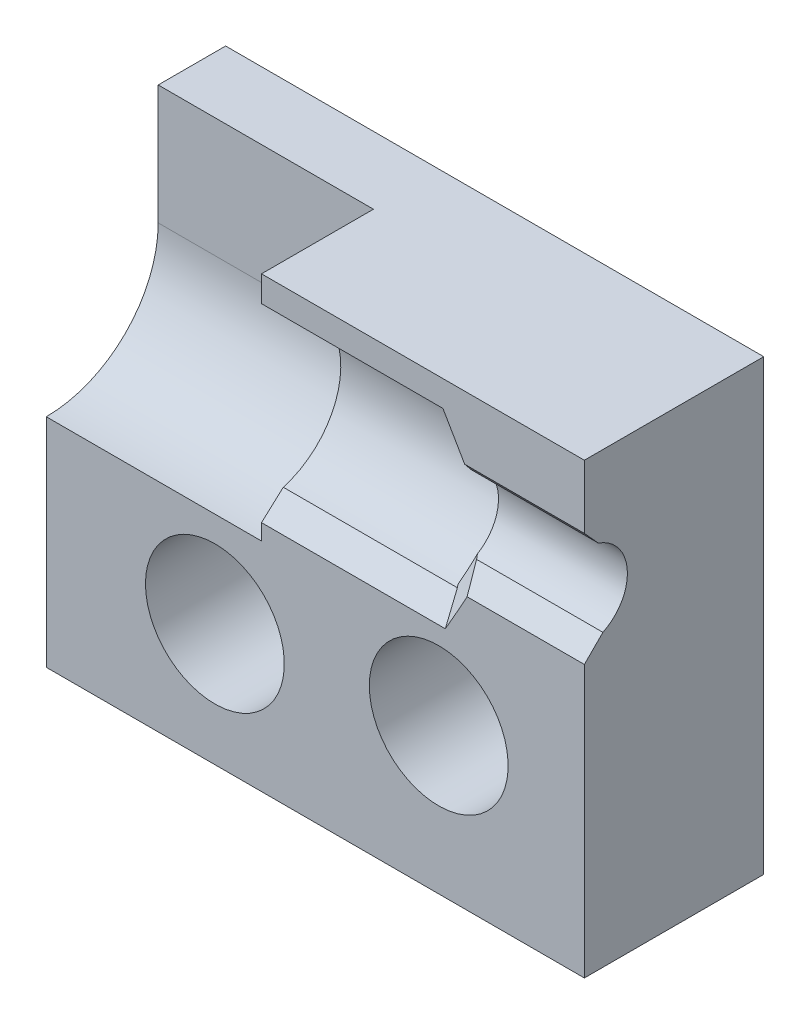
ISO-10303-21;
HEADER;
FILE_DESCRIPTION(('STEP AP214'),'2;1');
FILE_NAME('part.step','',(''),(''),'','','');
FILE_SCHEMA(('AUTOMOTIVE_DESIGN { 1 0 10303 214 1 1 1 1 }'));
ENDSEC;
DATA;
#1=APPLICATION_CONTEXT('core data for automotive mechanical design processes');
#2=APPLICATION_PROTOCOL_DEFINITION('international standard','automotive_design',2000,#1);
#3=PRODUCT_CONTEXT('',#1,'mechanical');
#4=PRODUCT('Part','Part','',(#3));
#5=PRODUCT_RELATED_PRODUCT_CATEGORY('part','',(#4));
#6=PRODUCT_DEFINITION_FORMATION('','',#4);
#7=PRODUCT_DEFINITION_CONTEXT('part definition',#1,'design');
#8=PRODUCT_DEFINITION('design','',#6,#7);
#9=PRODUCT_DEFINITION_SHAPE('','',#8);
#10=(LENGTH_UNIT() NAMED_UNIT(*) SI_UNIT(.MILLI.,.METRE.));
#11=(NAMED_UNIT(*) PLANE_ANGLE_UNIT() SI_UNIT($,.RADIAN.));
#12=(NAMED_UNIT(*) SI_UNIT($,.STERADIAN.) SOLID_ANGLE_UNIT());
#13=UNCERTAINTY_MEASURE_WITH_UNIT(LENGTH_MEASURE(1.E-05),#10,'distance_accuracy_value','');
#14=(GEOMETRIC_REPRESENTATION_CONTEXT(3) GLOBAL_UNCERTAINTY_ASSIGNED_CONTEXT((#13)) GLOBAL_UNIT_ASSIGNED_CONTEXT((#10,
#11,#12)) REPRESENTATION_CONTEXT('',''));
#15=CARTESIAN_POINT('',(0.,0.,0.));
#16=DIRECTION('',(0.,0.,1.));
#17=DIRECTION('',(1.,0.,0.));
#18=AXIS2_PLACEMENT_3D('',#15,#16,#17);
#19=CARTESIAN_POINT('',(0.,15.875,6.35));
#20=DIRECTION('',(0.,0.,-1.));
#21=DIRECTION('',(-1.,0.,0.));
#22=AXIS2_PLACEMENT_3D('',#19,#20,#21);
#23=PLANE('',#22);
#24=CARTESIAN_POINT('',(15.0272325030266,13.2523683147048,6.35));
#25=CARTESIAN_POINT('',(14.6930460971843,13.854183981208,6.35));
#26=CARTESIAN_POINT('',(14.3438732184202,14.4476738563301,6.35));
#27=CARTESIAN_POINT('',(13.9950574192766,15.0411122708672,6.35));
#28=B_SPLINE_CURVE_WITH_KNOTS('',3,(#24,#25,#26,#27),.UNSPECIFIED.,.F.,.F.,(4,4),
(0.0125208708196939,0.0145860459214774),.UNSPECIFIED.);
#29=CARTESIAN_POINT('',(14.0426262246929,14.9601839397091,6.35));
#30=VERTEX_POINT('',#29);
#31=CARTESIAN_POINT('',(14.813371744153,13.6331934584509,6.35));
#32=VERTEX_POINT('',#31);
#33=EDGE_CURVE('E254',#30,#32,#28,.F.);
#34=ORIENTED_EDGE('',*,*,#33,.T.);
#35=DIRECTION('',(1.,0.,0.));
#36=VECTOR('',#35,1.);
#37=CARTESIAN_POINT('',(0.,13.6332163692626,6.35));
#38=LINE('',#37,#36);
#39=CARTESIAN_POINT('',(19.05,13.6332163692626,6.35));
#40=VERTEX_POINT('',#39);
#41=EDGE_CURVE('E247',#32,#40,#38,.T.);
#42=ORIENTED_EDGE('',*,*,#41,.T.);
#43=DIRECTION('',(0.,1.,0.));
#44=VECTOR('',#43,1.);
#45=CARTESIAN_POINT('',(19.05,0.,6.35));
#46=LINE('',#45,#44);
#47=CARTESIAN_POINT('',(19.05,15.875,6.35));
#48=VERTEX_POINT('',#47);
#49=EDGE_CURVE('E179',#40,#48,#46,.T.);
#50=ORIENTED_EDGE('',*,*,#49,.T.);
#51=DIRECTION('',(-1.,0.,0.));
#52=VECTOR('',#51,1.);
#53=CARTESIAN_POINT('',(0.,15.875,6.35));
#54=LINE('',#53,#52);
#55=CARTESIAN_POINT('',(7.62,15.875,6.35));
#56=VERTEX_POINT('',#55);
#57=EDGE_CURVE('E173',#48,#56,#54,.T.);
#58=ORIENTED_EDGE('',*,*,#57,.T.);
#59=DIRECTION('',(0.,1.,0.));
#60=VECTOR('',#59,1.);
#61=CARTESIAN_POINT('',(7.62,15.875,6.35));
#62=LINE('',#61,#60);
#63=CARTESIAN_POINT('',(7.62,14.9602203597438,6.35));
#64=VERTEX_POINT('',#63);
#65=EDGE_CURVE('E153',#64,#56,#62,.T.);
#66=ORIENTED_EDGE('',*,*,#65,.F.);
#67=DIRECTION('',(1.,0.,0.));
#68=VECTOR('',#67,1.);
#69=CARTESIAN_POINT('',(0.,14.9602203597438,6.35));
#70=LINE('',#69,#68);
#71=EDGE_CURVE('E494',#64,#30,#70,.T.);
#72=ORIENTED_EDGE('',*,*,#71,.T.);
#73=EDGE_LOOP('',(#34,#42,#50,#58,#66,#72));
#74=FACE_BOUND('',#73,.T.);
#75=ADVANCED_FACE('F32',(#74),#23,.F.);
#76=CARTESIAN_POINT('',(0.,11.6455203597438,6.35));
#77=DIRECTION('',(-1.,0.,0.));
#78=DIRECTION('',(0.,0.,1.));
#79=AXIS2_PLACEMENT_3D('',#76,#77,#78);
#80=CYLINDRICAL_SURFACE('',#79,1.52399999999999);
#81=CARTESIAN_POINT('',(14.4867239160267,11.6455203597438,6.35));
#82=DIRECTION('',(-1.,0.,0.));
#83=DIRECTION('',(0.,0.,1.));
#84=AXIS2_PLACEMENT_3D('',#81,#82,#83);
#85=CIRCLE('',#84,1.52399999999999);
#86=CARTESIAN_POINT('',(14.4867239160267,13.0586816291112,5.7794290344226));
#87=VERTEX_POINT('',#86);
#88=CARTESIAN_POINT('',(14.4867239160267,10.3355804008468,5.57113332072498));
#89=VERTEX_POINT('',#88);
#90=EDGE_CURVE('E450',#87,#89,#85,.T.);
#91=ORIENTED_EDGE('',*,*,#90,.T.);
#92=CARTESIAN_POINT('',(14.5773362035777,10.2703101149009,5.69321024484276));
#93=CARTESIAN_POINT('',(14.5735542399492,10.2730306487401,5.6881219503381));
#94=CARTESIAN_POINT('',(14.5697716922259,10.275750973923,5.68303397840956));
#95=CARTESIAN_POINT('',(14.5622065403192,10.281190403076,5.67286018080662));
#96=CARTESIAN_POINT('',(14.5584239364809,10.2839095071697,5.66777435494163));
#97=CARTESIAN_POINT('',(14.5508586722863,10.2893464907526,5.65760485343783));
#98=CARTESIAN_POINT('',(14.5470760122767,10.2920643703661,5.65252117760762));
#99=CARTESIAN_POINT('',(14.5395106356788,10.2974989015892,5.64235598015198));
#100=CARTESIAN_POINT('',(14.5357279194389,10.3002155533241,5.63727445833435));
#101=CARTESIAN_POINT('',(14.5281624303206,10.3056476253862,5.62711357288678));
#102=CARTESIAN_POINT('',(14.5243796577921,10.3083630458396,5.62203420906385));
#103=CARTESIAN_POINT('',(14.5168140560365,10.3137926519292,5.61187764359367));
#104=CARTESIAN_POINT('',(14.5130312271608,10.3165068376926,5.60680044175263));
#105=CARTESIAN_POINT('',(14.5054655126515,10.3219339709887,5.59664820423857));
#106=CARTESIAN_POINT('',(14.5016826273708,10.3246469186493,5.59157316837094));
#107=CARTESIAN_POINT('',(14.4941167999893,10.3300715723186,5.58142526680262));
#108=CARTESIAN_POINT('',(14.490333858243,10.3327832784561,5.57635240090651));
#109=CARTESIAN_POINT('',(14.4865503217288,10.3354947679233,5.5712798628187));
#110=B_SPLINE_CURVE_WITH_KNOTS('',3,(#92,#93,#94,#95,#96,#97,#98,#99,#100,#101,#102,#103,#104,
#105,#106,#107,#108,#109),.UNSPECIFIED.,.F.,.F.,(4,2,2,2,2,2,2,2,4),(0.,0.0206968028110682,
0.0413875057109673,0.0620720968516414,0.0827505643743841,0.103422896409848,0.124089081078086,
0.144749106488594,0.165402960740324),.UNSPECIFIED.);
#111=CARTESIAN_POINT('',(14.5773362035777,10.2703101149011,5.69321024484276));
#112=VERTEX_POINT('',#111);
#113=EDGE_CURVE('E498',#89,#112,#110,.F.);
#114=ORIENTED_EDGE('',*,*,#113,.T.);
#115=DIRECTION('',(-1.,0.,0.));
#116=VECTOR('',#115,1.);
#117=CARTESIAN_POINT('',(0.,10.2703101149011,5.69321024484276));
#118=LINE('',#117,#116);
#119=CARTESIAN_POINT('',(19.05,10.2703101149011,5.69321024484276));
#120=VERTEX_POINT('',#119);
#121=EDGE_CURVE('E504',#112,#120,#118,.F.);
#122=ORIENTED_EDGE('',*,*,#121,.T.);
#123=CARTESIAN_POINT('',(19.05,11.6455203597438,6.35));
#124=DIRECTION('',(-1.,0.,0.));
#125=DIRECTION('',(0.,0.,1.));
#126=AXIS2_PLACEMENT_3D('',#123,#124,#125);
#127=CIRCLE('',#126,1.52399999999999);
#128=CARTESIAN_POINT('',(19.05,13.0870454038309,5.85544813490412));
#129=VERTEX_POINT('',#128);
#130=EDGE_CURVE('E194',#129,#120,#127,.T.);
#131=ORIENTED_EDGE('',*,*,#130,.F.);
#132=DIRECTION('',(-1.,0.,0.));
#133=VECTOR('',#132,1.);
#134=CARTESIAN_POINT('',(0.,13.0870454038309,5.85544813490412));
#135=LINE('',#134,#133);
#136=CARTESIAN_POINT('',(14.5567864539065,13.0870454038309,5.85544813490412));
#137=VERTEX_POINT('',#136);
#138=EDGE_CURVE('E506',#129,#137,#135,.T.);
#139=ORIENTED_EDGE('',*,*,#138,.T.);
#140=CARTESIAN_POINT('',(14.4889580050918,13.0546581825526,5.77977641574447));
#141=CARTESIAN_POINT('',(14.9839030485928,13.3302034025834,6.35));
#142=B_SPLINE_CURVE_WITH_KNOTS('',1,(#140,#141),.UNSPECIFIED.,.F.,.F.,(2,2),(0.,1.),.UNSPECIFIED.);
#143=EDGE_CURVE('E429',#137,#87,#142,.F.);
#144=ORIENTED_EDGE('',*,*,#143,.T.);
#145=EDGE_LOOP('',(#91,#114,#122,#131,#139,#144));
#146=FACE_BOUND('',#145,.T.);
#147=ADVANCED_FACE('F234',(#146),#80,.F.);
#148=CARTESIAN_POINT('',(13.8938,5.1562,6.35));
#149=DIRECTION('',(0.,0.,-1.));
#150=DIRECTION('',(-1.,0.,0.));
#151=AXIS2_PLACEMENT_3D('',#148,#149,#150);
#152=CIRCLE('',#151,2.45745);
#153=CARTESIAN_POINT('',(11.43635,5.1562,6.35));
#154=VERTEX_POINT('',#153);
#155=EDGE_CURVE('E724',#154,#154,#152,.T.);
#156=ORIENTED_EDGE('',*,*,#155,.T.);
#157=EDGE_LOOP('',(#156));
#158=FACE_BOUND('',#157,.T.);
#159=CARTESIAN_POINT('',(5.969,4.318,6.35));
#160=DIRECTION('',(0.,0.,-1.));
#161=DIRECTION('',(-1.,0.,0.));
#162=AXIS2_PLACEMENT_3D('',#159,#160,#161);
#163=CIRCLE('',#162,2.45745);
#164=CARTESIAN_POINT('',(3.51155,4.318,6.35));
#165=VERTEX_POINT('',#164);
#166=EDGE_CURVE('E37',#165,#165,#163,.T.);
#167=ORIENTED_EDGE('',*,*,#166,.T.);
#168=EDGE_LOOP('',(#167));
#169=FACE_BOUND('',#168,.T.);
#170=CARTESIAN_POINT('',(14.0771944514698,8.1593071037629,6.35));
#171=CARTESIAN_POINT('',(14.4471798396223,8.80144046239248,6.35));
#172=CARTESIAN_POINT('',(14.8184791245632,9.4438242553936,6.35));
#173=CARTESIAN_POINT('',(15.1567177201664,10.1033175102189,6.35));
#174=B_SPLINE_CURVE_WITH_KNOTS('',3,(#170,#171,#172,#173),.UNSPECIFIED.,.F.,.F.,(4,4),
(0.0132581732775287,0.0154818001649968),.UNSPECIFIED.);
#175=CARTESIAN_POINT('',(14.8984219469262,9.61357444403086,6.35));
#176=VERTEX_POINT('',#175);
#177=CARTESIAN_POINT('',(14.127729104142,8.2468484496813,6.35));
#178=VERTEX_POINT('',#177);
#179=EDGE_CURVE('E211',#176,#178,#174,.F.);
#180=ORIENTED_EDGE('',*,*,#179,.T.);
#181=DIRECTION('',(-1.,0.,0.));
#182=VECTOR('',#181,1.);
#183=CARTESIAN_POINT('',(0.,8.24680872276958,6.35));
#184=LINE('',#183,#182);
#185=CARTESIAN_POINT('',(7.62,8.24680872276958,6.35));
#186=VERTEX_POINT('',#185);
#187=EDGE_CURVE('E223',#178,#186,#184,.T.);
#188=ORIENTED_EDGE('',*,*,#187,.T.);
#189=DIRECTION('',(0.,1.,0.));
#190=VECTOR('',#189,1.);
#191=CARTESIAN_POINT('',(7.62,15.875,6.35));
#192=LINE('',#191,#190);
#193=CARTESIAN_POINT('',(7.62,7.68312035974381,6.35));
#194=VERTEX_POINT('',#193);
#195=EDGE_CURVE('E469',#194,#186,#192,.T.);
#196=ORIENTED_EDGE('',*,*,#195,.F.);
#197=DIRECTION('',(-1.,0.,0.));
#198=VECTOR('',#197,1.);
#199=CARTESIAN_POINT('',(7.62,7.68312035974381,6.35));
#200=LINE('',#199,#198);
#201=CARTESIAN_POINT('',(0.,7.68312035974381,6.35));
#202=VERTEX_POINT('',#201);
#203=EDGE_CURVE('E472',#194,#202,#200,.T.);
#204=ORIENTED_EDGE('',*,*,#203,.T.);
#205=DIRECTION('',(0.,-1.,0.));
#206=VECTOR('',#205,1.);
#207=CARTESIAN_POINT('',(0.,0.,6.35));
#208=LINE('',#207,#206);
#209=CARTESIAN_POINT('',(0.,0.,6.35));
#210=VERTEX_POINT('',#209);
#211=EDGE_CURVE('E200',#202,#210,#208,.T.);
#212=ORIENTED_EDGE('',*,*,#211,.T.);
#213=DIRECTION('',(1.,0.,0.));
#214=VECTOR('',#213,1.);
#215=CARTESIAN_POINT('',(0.,0.,6.35));
#216=LINE('',#215,#214);
#217=CARTESIAN_POINT('',(19.05,0.,6.35));
#218=VERTEX_POINT('',#217);
#219=EDGE_CURVE('E477',#210,#218,#216,.T.);
#220=ORIENTED_EDGE('',*,*,#219,.T.);
#221=CARTESIAN_POINT('',(19.05,9.61352035974377,6.35));
#222=VERTEX_POINT('',#221);
#223=EDGE_CURVE('E182',#218,#222,#46,.T.);
#224=ORIENTED_EDGE('',*,*,#223,.T.);
#225=DIRECTION('',(-1.,0.,0.));
#226=VECTOR('',#225,1.);
#227=CARTESIAN_POINT('',(0.,9.61352035974377,6.35));
#228=LINE('',#227,#226);
#229=EDGE_CURVE('E209',#222,#176,#228,.T.);
#230=ORIENTED_EDGE('',*,*,#229,.T.);
#231=EDGE_LOOP('',(#180,#188,#196,#204,#212,#220,#224,#230));
#232=FACE_BOUND('',#231,.T.);
#233=ADVANCED_FACE('F235',(#158,#169,#232),#23,.F.);
#234=CARTESIAN_POINT('',(0.,0.,6.35));
#235=DIRECTION('',(1.,0.,0.));
#236=DIRECTION('',(0.,0.,-1.));
#237=AXIS2_PLACEMENT_3D('',#234,#235,#236);
#238=PLANE('',#237);
#239=ORIENTED_EDGE('',*,*,#211,.F.);
#240=CARTESIAN_POINT('',(0.,11.6455203597438,6.35));
#241=DIRECTION('',(-1.,0.,0.));
#242=DIRECTION('',(0.,0.,1.));
#243=AXIS2_PLACEMENT_3D('',#240,#241,#242);
#244=CIRCLE('',#243,3.9624);
#245=CARTESIAN_POINT('',(0.,11.6455203597438,2.3876));
#246=VERTEX_POINT('',#245);
#247=EDGE_CURVE('E463',#246,#202,#244,.T.);
#248=ORIENTED_EDGE('',*,*,#247,.F.);
#249=DIRECTION('',(0.,-1.,0.));
#250=VECTOR('',#249,1.);
#251=CARTESIAN_POINT('',(0.,11.6455203597438,2.3876));
#252=LINE('',#251,#250);
#253=CARTESIAN_POINT('',(0.,15.875,2.3876));
#254=VERTEX_POINT('',#253);
#255=EDGE_CURVE('E460',#254,#246,#252,.T.);
#256=ORIENTED_EDGE('',*,*,#255,.F.);
#257=DIRECTION('',(0.,0.,-1.));
#258=VECTOR('',#257,1.);
#259=CARTESIAN_POINT('',(0.,15.875,6.35));
#260=LINE('',#259,#258);
#261=CARTESIAN_POINT('',(0.,15.875,0.));
#262=VERTEX_POINT('',#261);
#263=EDGE_CURVE('E181',#254,#262,#260,.T.);
#264=ORIENTED_EDGE('',*,*,#263,.T.);
#265=DIRECTION('',(0.,-1.,0.));
#266=VECTOR('',#265,1.);
#267=CARTESIAN_POINT('',(0.,0.,0.));
#268=LINE('',#267,#266);
#269=CARTESIAN_POINT('',(0.,0.,0.));
#270=VERTEX_POINT('',#269);
#271=EDGE_CURVE('E190',#262,#270,#268,.T.);
#272=ORIENTED_EDGE('',*,*,#271,.T.);
#273=DIRECTION('',(0.,0.,-1.));
#274=VECTOR('',#273,1.);
#275=CARTESIAN_POINT('',(0.,0.,6.35));
#276=LINE('',#275,#274);
#277=EDGE_CURVE('E206',#210,#270,#276,.T.);
#278=ORIENTED_EDGE('',*,*,#277,.F.);
#279=EDGE_LOOP('',(#239,#248,#256,#264,#272,#278));
#280=FACE_BOUND('',#279,.T.);
#281=ADVANCED_FACE('F311',(#280),#238,.F.);
#282=CARTESIAN_POINT('',(0.,0.,6.35));
#283=DIRECTION('',(0.,1.,0.));
#284=DIRECTION('',(0.,0.,1.));
#285=AXIS2_PLACEMENT_3D('',#282,#283,#284);
#286=PLANE('',#285);
#287=DIRECTION('',(1.,0.,0.));
#288=VECTOR('',#287,1.);
#289=CARTESIAN_POINT('',(0.,0.,0.));
#290=LINE('',#289,#288);
#291=CARTESIAN_POINT('',(19.05,0.,0.));
#292=VERTEX_POINT('',#291);
#293=EDGE_CURVE('E193',#270,#292,#290,.T.);
#294=ORIENTED_EDGE('',*,*,#293,.T.);
#295=DIRECTION('',(0.,0.,-1.));
#296=VECTOR('',#295,1.);
#297=CARTESIAN_POINT('',(19.05,0.,6.35));
#298=LINE('',#297,#296);
#299=EDGE_CURVE('E203',#218,#292,#298,.T.);
#300=ORIENTED_EDGE('',*,*,#299,.F.);
#301=ORIENTED_EDGE('',*,*,#219,.F.);
#302=ORIENTED_EDGE('',*,*,#277,.T.);
#303=EDGE_LOOP('',(#294,#300,#301,#302));
#304=FACE_BOUND('',#303,.T.);
#305=ADVANCED_FACE('F485',(#304),#286,.F.);
#306=CARTESIAN_POINT('',(19.05,0.,6.35));
#307=DIRECTION('',(-1.,0.,0.));
#308=DIRECTION('',(0.,0.,1.));
#309=AXIS2_PLACEMENT_3D('',#306,#307,#308);
#310=PLANE('',#309);
#311=ORIENTED_EDGE('',*,*,#130,.T.);
#312=DIRECTION('',(0.,0.707106781186577,-0.707106781186518));
#313=VECTOR('',#312,1.);
#314=CARTESIAN_POINT('',(19.05,9.61352035974377,6.35));
#315=LINE('',#314,#313);
#316=EDGE_CURVE('E490',#120,#222,#315,.F.);
#317=ORIENTED_EDGE('',*,*,#316,.T.);
#318=ORIENTED_EDGE('',*,*,#223,.F.);
#319=ORIENTED_EDGE('',*,*,#299,.T.);
#320=DIRECTION('',(0.,1.,0.));
#321=VECTOR('',#320,1.);
#322=CARTESIAN_POINT('',(19.05,0.,0.));
#323=LINE('',#322,#321);
#324=CARTESIAN_POINT('',(19.05,15.875,0.));
#325=VERTEX_POINT('',#324);
#326=EDGE_CURVE('E196',#292,#325,#323,.T.);
#327=ORIENTED_EDGE('',*,*,#326,.T.);
#328=DIRECTION('',(0.,0.,-1.));
#329=VECTOR('',#328,1.);
#330=CARTESIAN_POINT('',(19.05,15.875,6.35));
#331=LINE('',#330,#329);
#332=EDGE_CURVE('E184',#48,#325,#331,.T.);
#333=ORIENTED_EDGE('',*,*,#332,.F.);
#334=ORIENTED_EDGE('',*,*,#49,.F.);
#335=DIRECTION('',(0.,-0.74126753483913,-0.671209685413969));
#336=VECTOR('',#335,1.);
#337=CARTESIAN_POINT('',(19.05,13.6332163692626,6.35));
#338=LINE('',#337,#336);
#339=EDGE_CURVE('E495',#40,#129,#338,.T.);
#340=ORIENTED_EDGE('',*,*,#339,.T.);
#341=EDGE_LOOP('',(#311,#317,#318,#319,#327,#333,#334,#340));
#342=FACE_BOUND('',#341,.T.);
#343=ADVANCED_FACE('F488',(#342),#310,.F.);
#344=CARTESIAN_POINT('',(0.,15.875,6.35));
#345=DIRECTION('',(0.,-1.,0.));
#346=DIRECTION('',(0.,0.,-1.));
#347=AXIS2_PLACEMENT_3D('',#344,#345,#346);
#348=PLANE('',#347);
#349=ORIENTED_EDGE('',*,*,#263,.F.);
#350=DIRECTION('',(-1.,0.,0.));
#351=VECTOR('',#350,1.);
#352=CARTESIAN_POINT('',(7.62,15.875,2.3876));
#353=LINE('',#352,#351);
#354=CARTESIAN_POINT('',(7.62,15.875,2.3876));
#355=VERTEX_POINT('',#354);
#356=EDGE_CURVE('E174',#355,#254,#353,.T.);
#357=ORIENTED_EDGE('',*,*,#356,.F.);
#358=DIRECTION('',(0.,0.,-1.));
#359=VECTOR('',#358,1.);
#360=CARTESIAN_POINT('',(7.62,15.875,2.3876));
#361=LINE('',#360,#359);
#362=EDGE_CURVE('E158',#56,#355,#361,.T.);
#363=ORIENTED_EDGE('',*,*,#362,.F.);
#364=ORIENTED_EDGE('',*,*,#57,.F.);
#365=ORIENTED_EDGE('',*,*,#332,.T.);
#366=DIRECTION('',(-1.,0.,0.));
#367=VECTOR('',#366,1.);
#368=CARTESIAN_POINT('',(0.,15.875,0.));
#369=LINE('',#368,#367);
#370=EDGE_CURVE('E198',#325,#262,#369,.T.);
#371=ORIENTED_EDGE('',*,*,#370,.T.);
#372=EDGE_LOOP('',(#349,#357,#363,#364,#365,#371));
#373=FACE_BOUND('',#372,.T.);
#374=ADVANCED_FACE('F171',(#373),#348,.F.);
#375=CARTESIAN_POINT('',(0.,15.875,0.));
#376=DIRECTION('',(0.,0.,-1.));
#377=DIRECTION('',(-1.,0.,0.));
#378=AXIS2_PLACEMENT_3D('',#375,#376,#377);
#379=PLANE('',#378);
#380=CARTESIAN_POINT('',(13.8938,5.1562,0.));
#381=DIRECTION('',(0.,0.,-1.));
#382=DIRECTION('',(-1.,0.,0.));
#383=AXIS2_PLACEMENT_3D('',#380,#381,#382);
#384=CIRCLE('',#383,2.45745);
#385=CARTESIAN_POINT('',(11.43635,5.1562,0.));
#386=VERTEX_POINT('',#385);
#387=EDGE_CURVE('E731',#386,#386,#384,.T.);
#388=ORIENTED_EDGE('',*,*,#387,.F.);
#389=EDGE_LOOP('',(#388));
#390=FACE_BOUND('',#389,.T.);
#391=CARTESIAN_POINT('',(5.969,4.318,0.));
#392=DIRECTION('',(0.,0.,-1.));
#393=DIRECTION('',(-1.,0.,0.));
#394=AXIS2_PLACEMENT_3D('',#391,#392,#393);
#395=CIRCLE('',#394,2.45745);
#396=CARTESIAN_POINT('',(3.51155,4.318,0.));
#397=VERTEX_POINT('',#396);
#398=EDGE_CURVE('E728',#397,#397,#395,.T.);
#399=ORIENTED_EDGE('',*,*,#398,.F.);
#400=EDGE_LOOP('',(#399));
#401=FACE_BOUND('',#400,.T.);
#402=ORIENTED_EDGE('',*,*,#271,.F.);
#403=ORIENTED_EDGE('',*,*,#370,.F.);
#404=ORIENTED_EDGE('',*,*,#326,.F.);
#405=ORIENTED_EDGE('',*,*,#293,.F.);
#406=EDGE_LOOP('',(#402,#403,#404,#405));
#407=FACE_BOUND('',#406,.T.);
#408=ADVANCED_FACE('F238',(#390,#401,#407),#379,.T.);
#409=CARTESIAN_POINT('',(7.62,11.6455203597438,6.35));
#410=DIRECTION('',(-1.,0.,0.));
#411=DIRECTION('',(0.,0.,1.));
#412=AXIS2_PLACEMENT_3D('',#409,#410,#411);
#413=CYLINDRICAL_SURFACE('',#412,3.9624);
#414=CARTESIAN_POINT('',(7.62,11.6455203597438,6.35));
#415=DIRECTION('',(-1.,0.,0.));
#416=DIRECTION('',(0.,0.,1.));
#417=AXIS2_PLACEMENT_3D('',#414,#415,#416);
#418=CIRCLE('',#417,3.9624);
#419=CARTESIAN_POINT('',(7.62,11.6455203597438,2.3876));
#420=VERTEX_POINT('',#419);
#421=EDGE_CURVE('E165',#420,#194,#418,.T.);
#422=ORIENTED_EDGE('',*,*,#421,.F.);
#423=DIRECTION('',(-1.,0.,0.));
#424=VECTOR('',#423,1.);
#425=CARTESIAN_POINT('',(7.62,11.6455203597438,2.3876));
#426=LINE('',#425,#424);
#427=EDGE_CURVE('E467',#420,#246,#426,.T.);
#428=ORIENTED_EDGE('',*,*,#427,.T.);
#429=ORIENTED_EDGE('',*,*,#247,.T.);
#430=ORIENTED_EDGE('',*,*,#203,.F.);
#431=EDGE_LOOP('',(#422,#428,#429,#430));
#432=FACE_BOUND('',#431,.T.);
#433=ADVANCED_FACE('F573',(#432),#413,.F.);
#434=CARTESIAN_POINT('',(7.62,11.6455203597438,6.35));
#435=DIRECTION('',(-1.,0.,0.));
#436=DIRECTION('',(0.,0.,1.));
#437=AXIS2_PLACEMENT_3D('',#434,#435,#436);
#438=PLANE('',#437);
#439=ORIENTED_EDGE('',*,*,#195,.T.);
#440=DIRECTION('',(0.,-0.6723100032128,0.74026972083154));
#441=VECTOR('',#440,1.);
#442=CARTESIAN_POINT('',(7.62,9.78302889915598,4.6584926958176));
#443=LINE('',#442,#441);
#444=CARTESIAN_POINT('',(7.62,8.94668674256926,5.57937557992983));
#445=VERTEX_POINT('',#444);
#446=EDGE_CURVE('E442',#186,#445,#443,.F.);
#447=ORIENTED_EDGE('',*,*,#446,.T.);
#448=CARTESIAN_POINT('',(7.62,11.6455203597438,6.35));
#449=DIRECTION('',(-1.,0.,0.));
#450=DIRECTION('',(0.,0.,1.));
#451=AXIS2_PLACEMENT_3D('',#448,#449,#450);
#452=CIRCLE('',#451,2.8067);
#453=CARTESIAN_POINT('',(7.62,14.3946457132392,5.7844253534954));
#454=VERTEX_POINT('',#453);
#455=EDGE_CURVE('E451',#454,#445,#452,.T.);
#456=ORIENTED_EDGE('',*,*,#455,.F.);
#457=DIRECTION('',(0.,0.707106781186546,0.707106781186549));
#458=VECTOR('',#457,1.);
#459=CARTESIAN_POINT('',(7.62,13.3028703597438,4.69265));
#460=LINE('',#459,#458);
#461=EDGE_CURVE('E161',#454,#64,#460,.T.);
#462=ORIENTED_EDGE('',*,*,#461,.T.);
#463=ORIENTED_EDGE('',*,*,#65,.T.);
#464=ORIENTED_EDGE('',*,*,#362,.T.);
#465=DIRECTION('',(0.,-1.,0.));
#466=VECTOR('',#465,1.);
#467=CARTESIAN_POINT('',(7.62,11.6455203597438,2.3876));
#468=LINE('',#467,#466);
#469=EDGE_CURVE('E175',#355,#420,#468,.T.);
#470=ORIENTED_EDGE('',*,*,#469,.T.);
#471=ORIENTED_EDGE('',*,*,#421,.T.);
#472=EDGE_LOOP('',(#439,#447,#456,#462,#463,#464,#470,#471));
#473=FACE_BOUND('',#472,.T.);
#474=ADVANCED_FACE('F156',(#473),#438,.T.);
#475=CARTESIAN_POINT('',(7.62,11.6455203597438,2.3876));
#476=DIRECTION('',(0.,0.,-1.));
#477=DIRECTION('',(-1.,0.,0.));
#478=AXIS2_PLACEMENT_3D('',#475,#476,#477);
#479=PLANE('',#478);
#480=ORIENTED_EDGE('',*,*,#255,.T.);
#481=ORIENTED_EDGE('',*,*,#427,.F.);
#482=ORIENTED_EDGE('',*,*,#469,.F.);
#483=ORIENTED_EDGE('',*,*,#356,.T.);
#484=EDGE_LOOP('',(#480,#481,#482,#483));
#485=FACE_BOUND('',#484,.T.);
#486=ADVANCED_FACE('F569',(#485),#479,.F.);
#487=CARTESIAN_POINT('',(13.716,11.6455203597438,6.35));
#488=DIRECTION('',(-1.,0.,0.));
#489=DIRECTION('',(0.,0.,1.));
#490=AXIS2_PLACEMENT_3D('',#487,#488,#489);
#491=CONICAL_SURFACE('',#490,2.8067,1.02974425867665);
#492=CARTESIAN_POINT('',(13.716,11.6455203597438,6.35));
#493=DIRECTION('',(-1.,0.,0.));
#494=DIRECTION('',(0.,0.,1.));
#495=AXIS2_PLACEMENT_3D('',#492,#493,#494);
#496=CIRCLE('',#495,2.8067);
#497=CARTESIAN_POINT('',(13.716,14.3836535337384,5.73340320186488));
#498=VERTEX_POINT('',#497);
#499=CARTESIAN_POINT('',(13.716,8.97258168206955,5.49386699900487));
#500=VERTEX_POINT('',#499);
#501=EDGE_CURVE('E447',#498,#500,#496,.T.);
#502=ORIENTED_EDGE('',*,*,#501,.T.);
#503=CARTESIAN_POINT('',(14.5328279953841,10.4205963933176,5.57918775494539));
#504=CARTESIAN_POINT('',(14.1945893997809,9.79661585597045,5.51940345546398));
#505=CARTESIAN_POINT('',(13.82329011484,9.15611682743808,5.49834738562394));
#506=CARTESIAN_POINT('',(13.4533047266875,8.52044631748475,5.48006393445382));
#507=B_SPLINE_CURVE_WITH_KNOTS('',3,(#503,#504,#505,#506),.UNSPECIFIED.,.F.,.F.,(4,4),
(0.0132581732775288,0.0154818001649968),.UNSPECIFIED.);
#508=EDGE_CURVE('E542',#500,#89,#507,.F.);
#509=ORIENTED_EDGE('',*,*,#508,.T.);
#510=ORIENTED_EDGE('',*,*,#90,.F.);
#511=CARTESIAN_POINT('',(13.5001123757756,14.7495409724562,5.72662594307888));
#512=CARTESIAN_POINT('',(13.8489281749192,14.15876983702,5.73728420092406));
#513=CARTESIAN_POINT('',(14.1981010536833,13.5660523333477,5.74864099958433));
#514=CARTESIAN_POINT('',(14.5322874595256,12.9786082481827,5.7842512327777));
#515=B_SPLINE_CURVE_WITH_KNOTS('',3,(#511,#512,#513,#514),.UNSPECIFIED.,.F.,.F.,(4,4),
(0.0125208708196939,0.0145860459214774),.UNSPECIFIED.);
#516=EDGE_CURVE('E439',#87,#498,#515,.F.);
#517=ORIENTED_EDGE('',*,*,#516,.T.);
#518=EDGE_LOOP('',(#502,#509,#510,#517));
#519=FACE_BOUND('',#518,.T.);
#520=ADVANCED_FACE('F276',(#519),#491,.F.);
#521=CARTESIAN_POINT('',(7.62,11.6455203597438,6.35));
#522=DIRECTION('',(-1.,0.,0.));
#523=DIRECTION('',(0.,0.,1.));
#524=AXIS2_PLACEMENT_3D('',#521,#522,#523);
#525=CYLINDRICAL_SURFACE('',#524,2.8067);
#526=ORIENTED_EDGE('',*,*,#455,.T.);
#527=DIRECTION('',(-1.,0.,0.));
#528=VECTOR('',#527,1.);
#529=CARTESIAN_POINT('',(7.62,8.94668674256926,5.57937557992983));
#530=LINE('',#529,#528);
#531=CARTESIAN_POINT('',(13.7834714594198,8.94668674256926,5.57937557992983));
#532=VERTEX_POINT('',#531);
#533=EDGE_CURVE('E56',#445,#532,#530,.F.);
#534=ORIENTED_EDGE('',*,*,#533,.T.);
#535=CARTESIAN_POINT('',(13.7159034759955,8.97253826801004,5.49400255416822));
#536=CARTESIAN_POINT('',(13.7187187467138,8.97146075054746,5.49756097527649));
#537=CARTESIAN_POINT('',(13.7215340983706,8.97038325123195,5.50111933784479));
#538=CARTESIAN_POINT('',(13.7271647962869,8.96822835304493,5.50823573413941));
#539=CARTESIAN_POINT('',(13.7299801425368,8.96715095417127,5.5117937678727));
#540=CARTESIAN_POINT('',(13.7356108296224,8.96499625699015,5.5189095061817));
#541=CARTESIAN_POINT('',(13.7384261704483,8.96391895868053,5.5224672107644));
#542=CARTESIAN_POINT('',(13.7440568466688,8.96176446275081,5.52958229045563));
#543=CARTESIAN_POINT('',(13.7468721820537,8.96068726512855,5.53313966557116));
#544=CARTESIAN_POINT('',(13.7525028473752,8.95853297069777,5.54025408601062));
#545=CARTESIAN_POINT('',(13.755318177302,8.95745587388708,5.54381113134156));
#546=CARTESIAN_POINT('',(13.7609488316902,8.95530178120463,5.5509248918935));
#547=CARTESIAN_POINT('',(13.7637641561419,8.95422478533069,5.55448160712152));
#548=CARTESIAN_POINT('',(13.7693947995628,8.95207089464782,5.56159470714843));
#549=CARTESIAN_POINT('',(13.7722101185223,8.9509939998367,5.56515109195434));
#550=CARTESIAN_POINT('',(13.7778407509418,8.94884031140669,5.57226353081686));
#551=CARTESIAN_POINT('',(13.7806560643921,8.9477635177856,5.57581958488052));
#552=CARTESIAN_POINT('',(13.7834714594198,8.94668674256926,5.57937557992983));
#553=B_SPLINE_CURVE_WITH_KNOTS('',3,(#535,#536,#537,#538,#539,#540,#541,#542,#543,#544,#545,
#546,#547,#548,#549,#550,#551,#552),.UNSPECIFIED.,.F.,.F.,(4,2,2,2,2,2,2,2,4),(0.,
0.0139907964361568,0.0279807607628228,0.0419698921683871,0.0559581898386358,0.0699456529567528,
0.0839322807033279,0.0979180722563352,0.111903026791162),.UNSPECIFIED.);
#554=EDGE_CURVE('E42',#532,#500,#553,.F.);
#555=ORIENTED_EDGE('',*,*,#554,.T.);
#556=ORIENTED_EDGE('',*,*,#501,.F.);
#557=CARTESIAN_POINT('',(13.7641901312038,14.3946457132392,5.7844253534954));
#558=CARTESIAN_POINT('',(13.7621797347421,14.3941890551223,5.78230541887135));
#559=CARTESIAN_POINT('',(13.7601693920385,14.3937323854526,5.78018543575547));
#560=CARTESIAN_POINT('',(13.7561487018492,14.3928189975612,5.77594525437839));
#561=CARTESIAN_POINT('',(13.7541383543695,14.3923622793382,5.77382505611177));
#562=CARTESIAN_POINT('',(13.7501176546507,14.3914487944015,5.76958444468913));
#563=CARTESIAN_POINT('',(13.7481073024176,14.3909920276866,5.76746403152771));
#564=CARTESIAN_POINT('',(13.7440865932148,14.3900784458264,5.76322299056974));
#565=CARTESIAN_POINT('',(13.7420762362512,14.38962163068,5.76110236276782));
#566=CARTESIAN_POINT('',(13.7380555176102,14.3887079520162,5.75686089278176));
#567=CARTESIAN_POINT('',(13.7360451559389,14.3882510884977,5.75474005059226));
#568=CARTESIAN_POINT('',(13.7320244279054,14.3873373131483,5.75049815208248));
#569=CARTESIAN_POINT('',(13.7300140615493,14.3868804013161,5.74837709575684));
#570=CARTESIAN_POINT('',(13.725993324169,14.3859665293971,5.74413476922484));
#571=CARTESIAN_POINT('',(13.7239829531508,14.385509569309,5.74201349901314));
#572=CARTESIAN_POINT('',(13.7199622064696,14.3845956009345,5.73777074495742));
#573=CARTESIAN_POINT('',(13.7179518308125,14.3841385926468,5.73564926110808));
#574=CARTESIAN_POINT('',(13.7159415084361,14.3836815729262,5.73352772923382));
#575=B_SPLINE_CURVE_WITH_KNOTS('',3,(#557,#558,#559,#560,#561,#562,#563,#564,#565,#566,#567,
#568,#569,#570,#571,#572,#573,#574),.UNSPECIFIED.,.F.,.F.,(4,2,2,2,2,2,2,2,4),(0.,
0.00887125585230279,0.0177430066864266,0.0266152518988987,0.0354879908897067,0.0443612230623194,
0.0532349478236556,0.0621091645841087,0.0709838727575429),.UNSPECIFIED.);
#576=CARTESIAN_POINT('',(13.7641901312038,14.3946457132392,5.7844253534954));
#577=VERTEX_POINT('',#576);
#578=EDGE_CURVE('E11',#498,#577,#575,.F.);
#579=ORIENTED_EDGE('',*,*,#578,.T.);
#580=DIRECTION('',(-1.,0.,0.));
#581=VECTOR('',#580,1.);
#582=CARTESIAN_POINT('',(7.62,14.3946457132392,5.7844253534954));
#583=LINE('',#582,#581);
#584=EDGE_CURVE('E49',#577,#454,#583,.T.);
#585=ORIENTED_EDGE('',*,*,#584,.T.);
#586=EDGE_LOOP('',(#526,#534,#555,#556,#579,#585));
#587=FACE_BOUND('',#586,.T.);
#588=ADVANCED_FACE('F265',(#587),#525,.F.);
#589=CARTESIAN_POINT('',(0.,9.61352035974377,6.35));
#590=DIRECTION('',(0.,-0.707106781186518,-0.707106781186577));
#591=DIRECTION('',(0.,0.707106781186577,-0.707106781186518));
#592=AXIS2_PLACEMENT_3D('',#589,#590,#591);
#593=PLANE('',#592);
#594=ORIENTED_EDGE('',*,*,#316,.F.);
#595=ORIENTED_EDGE('',*,*,#121,.F.);
#596=CARTESIAN_POINT('',(14.8983842796357,9.61353880101187,6.3499815587319));
#597=CARTESIAN_POINT('',(14.8851683068905,9.64131211545406,6.3216744431394));
#598=CARTESIAN_POINT('',(14.8719060809154,9.66910572447745,6.29340879315268));
#599=CARTESIAN_POINT('',(14.8453506618983,9.72459071596655,6.2371099073041));
#600=CARTESIAN_POINT('',(14.8320579792648,9.7522818886427,6.20907622389861));
#601=CARTESIAN_POINT('',(14.805440679486,9.80755267222944,6.15325321218399));
#602=CARTESIAN_POINT('',(14.7921166394063,9.83513205980612,6.12546338769751));
#603=CARTESIAN_POINT('',(14.7654355130195,9.89016945222602,6.07014056733775));
#604=CARTESIAN_POINT('',(14.7520790790585,9.91762722007646,6.04260702116074));
#605=CARTESIAN_POINT('',(14.7253320852973,9.97241108264694,5.98780965706588));
#606=CARTESIAN_POINT('',(14.7119422616003,9.99973692661736,5.96054522927638));
#607=CARTESIAN_POINT('',(14.6851273740741,10.0542461751493,5.906299469503));
#608=CARTESIAN_POINT('',(14.6717031398552,10.0814293152684,5.87931746180544));
#609=CARTESIAN_POINT('',(14.6448183685386,10.1356419228577,5.82565031996406));
#610=CARTESIAN_POINT('',(14.6313587646937,10.1626711123433,5.79896443772041));
#611=CARTESIAN_POINT('',(14.6044019615651,10.2165640887741,5.74590392578137));
#612=CARTESIAN_POINT('',(14.5909058124096,10.2434275847325,5.7195284669305));
#613=CARTESIAN_POINT('',(14.5773362035777,10.2703101149011,5.69321024484276));
#614=B_SPLINE_CURVE_WITH_KNOTS('',3,(#596,#597,#598,#599,#600,#601,#602,#603,#604,#605,#606,
#607,#608,#609,#610,#611,#612,#613),.UNSPECIFIED.,.F.,.F.,(4,2,2,2,2,2,2,2,4),(0.,
0.125402563435125,0.250159917118622,0.374231580208827,0.497575427652995,0.62014771322691,
0.741903095231029,0.862794665182404,0.982773979893002),.UNSPECIFIED.);
#615=EDGE_CURVE('E740',#176,#112,#614,.T.);
#616=ORIENTED_EDGE('',*,*,#615,.F.);
#617=ORIENTED_EDGE('',*,*,#229,.F.);
#618=EDGE_LOOP('',(#594,#595,#616,#617));
#619=FACE_BOUND('',#618,.T.);
#620=ADVANCED_FACE('F275',(#619),#593,.F.);
#621=CARTESIAN_POINT('',(15.1567177201664,10.1033175102189,6.35));
#622=CARTESIAN_POINT('',(14.8184791245632,9.4438242553936,6.35));
#623=CARTESIAN_POINT('',(14.4471798396223,8.80144046239248,6.35));
#624=CARTESIAN_POINT('',(14.0771944514698,8.1593071037629,6.35));
#625=CARTESIAN_POINT('',(14.5328279953841,10.4205963933176,5.57918775494539));
#626=CARTESIAN_POINT('',(14.1945893997809,9.79661585597045,5.51940345546398));
#627=CARTESIAN_POINT('',(13.82329011484,9.15611682743808,5.49834738562394));
#628=CARTESIAN_POINT('',(13.4533047266875,8.52044631748475,5.48006393445382));
#629=B_SPLINE_SURFACE_WITH_KNOTS('',1,3,((#621,#622,#623,#624),(#625,#626,#627,#628)),
.UNSPECIFIED.,.F.,.F.,.F.,(2,2),(4,4),(0.,1.),(0.0132581732775288,0.0154818001649968),.UNSPECIFIED.);
#630=CARTESIAN_POINT('',(13.7834714594198,8.94668674256926,5.57937557992983));
#631=CARTESIAN_POINT('',(13.7978507628074,8.91761647493448,5.61104338583247));
#632=CARTESIAN_POINT('',(13.8122079918143,8.88856460941321,5.64273809803619));
#633=CARTESIAN_POINT('',(13.8409151264796,8.83042723568081,5.70625460468573));
#634=CARTESIAN_POINT('',(13.8552649329161,8.80134181260804,5.73807652190785));
#635=CARTESIAN_POINT('',(13.8839582838023,8.74313899702719,5.80184252393109));
#636=CARTESIAN_POINT('',(13.898301738571,8.71402168396143,5.83378672158941));
#637=CARTESIAN_POINT('',(13.9269833798869,8.65575623408206,5.89779286970214));
#638=CARTESIAN_POINT('',(13.9413214846579,8.62660817147197,5.92985492434471));
#639=CARTESIAN_POINT('',(13.9699934407875,8.56828186368184,5.99409284353827));
#640=CARTESIAN_POINT('',(13.9843272170024,8.53910368794356,6.02626880467507));
#641=CARTESIAN_POINT('',(14.0129915228952,8.4807172827527,6.09073107458994));
#642=CARTESIAN_POINT('',(14.0273219828617,8.45150911839924,6.12301747332578));
#643=CARTESIAN_POINT('',(14.0559806813528,8.3930623608561,6.1876976306581));
#644=CARTESIAN_POINT('',(14.0703088545693,8.3638238288122,6.22009147343914));
#645=CARTESIAN_POINT('',(14.0989639463346,8.30531543141761,6.28498402206718));
#646=CARTESIAN_POINT('',(14.1132908028885,8.27604562354224,6.31748280711248));
#647=CARTESIAN_POINT('',(14.1276031055205,8.24678916178787,6.35));
#648=B_SPLINE_CURVE_WITH_KNOTS('',3,(#630,#631,#632,#633,#634,#635,#636,#637,#638,#639,#640,
#641,#642,#643,#644,#645,#646,#647),.UNSPECIFIED.,.F.,.F.,(4,2,2,2,2,2,2,2,4),(0.,
0.135986195958427,0.272296877854727,0.408919880063419,0.545844975553055,0.683063879846831,
0.820570254636532,0.958359711102597,1.09642981299021),.UNSPECIFIED.);
#649=EDGE_CURVE('E294',#178,#532,#648,.F.);
#650=ORIENTED_EDGE('',*,*,#508,.F.);
#651=ORIENTED_EDGE('',*,*,#554,.F.);
#652=ORIENTED_EDGE('',*,*,#649,.F.);
#653=ORIENTED_EDGE('',*,*,#179,.F.);
#654=ORIENTED_EDGE('',*,*,#615,.T.);
#655=ORIENTED_EDGE('',*,*,#113,.F.);
#656=EDGE_LOOP('',(#650,#651,#652,#653,#654,#655));
#657=FACE_BOUND('',#656,.T.);
#658=ADVANCED_FACE('F310',(#657),#629,.T.);
#659=CARTESIAN_POINT('',(7.62,8.24680872276958,6.35));
#660=DIRECTION('',(0.,-0.74026972083154,-0.6723100032128));
#661=DIRECTION('',(0.,0.6723100032128,-0.74026972083154));
#662=AXIS2_PLACEMENT_3D('',#659,#660,#661);
#663=PLANE('',#662);
#664=ORIENTED_EDGE('',*,*,#649,.T.);
#665=ORIENTED_EDGE('',*,*,#533,.F.);
#666=ORIENTED_EDGE('',*,*,#446,.F.);
#667=ORIENTED_EDGE('',*,*,#187,.F.);
#668=EDGE_LOOP('',(#664,#665,#666,#667));
#669=FACE_BOUND('',#668,.T.);
#670=ADVANCED_FACE('F300',(#669),#663,.F.);
#671=CARTESIAN_POINT('',(7.62,14.9602203597438,6.35));
#672=DIRECTION('',(0.,-0.707106781186549,0.707106781186546));
#673=DIRECTION('',(0.,-0.707106781186546,-0.707106781186549));
#674=AXIS2_PLACEMENT_3D('',#671,#672,#673);
#675=PLANE('',#674);
#676=ORIENTED_EDGE('',*,*,#584,.F.);
#677=CARTESIAN_POINT('',(14.0425991762471,14.9602086860078,6.34998832626396));
#678=CARTESIAN_POINT('',(14.0310099891827,14.936613182757,6.32621971458737));
#679=CARTESIAN_POINT('',(14.0194137218105,14.913009419751,6.30246275323602));
#680=CARTESIAN_POINT('',(13.996220583929,14.8658132431825,6.25500145448743));
#681=CARTESIAN_POINT('',(13.9846237309175,14.8422208501104,6.23129708816327));
#682=CARTESIAN_POINT('',(13.9614291522464,14.7950470989494,6.18394180675048));
#683=CARTESIAN_POINT('',(13.9498314446351,14.7714657620711,6.16029086169323));
#684=CARTESIAN_POINT('',(13.9266348668804,14.724313935758,6.11304346694611));
#685=CARTESIAN_POINT('',(13.9150360155505,14.7007434683991,6.08944698598894));
#686=CARTESIAN_POINT('',(13.8918368660694,14.6536133268988,6.04230975993422));
#687=CARTESIAN_POINT('',(13.8802365876927,14.6300536758461,6.01876898202012));
#688=CARTESIAN_POINT('',(13.8570342966144,14.5829452438305,5.97174460599381));
#689=CARTESIAN_POINT('',(13.8454323048694,14.5593964871306,5.94826097323588));
#690=CARTESIAN_POINT('',(13.8222263055546,14.5123100542005,5.90135252713706));
#691=CARTESIAN_POINT('',(13.8106223203507,14.4887724035779,5.87792767702828));
#692=CARTESIAN_POINT('',(13.787412030501,14.4417085192068,5.8311386556284));
#693=CARTESIAN_POINT('',(13.7758057499154,14.4181823126034,5.8077744450969));
#694=CARTESIAN_POINT('',(13.7641901312038,14.3946457132392,5.7844253534954));
#695=B_SPLINE_CURVE_WITH_KNOTS('',3,(#677,#678,#679,#680,#681,#682,#683,#684,#685,#686,#687,
#688,#689,#690,#691,#692,#693,#694),.UNSPECIFIED.,.F.,.F.,(4,2,2,2,2,2,2,2,4),(0.,
0.106320435189255,0.212513004027585,0.318577030515877,0.424511180034469,0.530313460558417,
0.635981223958326,0.741511167395937,0.846899334824281),.UNSPECIFIED.);
#696=EDGE_CURVE('E553',#30,#577,#695,.T.);
#697=ORIENTED_EDGE('',*,*,#696,.F.);
#698=ORIENTED_EDGE('',*,*,#71,.F.);
#699=ORIENTED_EDGE('',*,*,#461,.F.);
#700=EDGE_LOOP('',(#676,#697,#698,#699));
#701=FACE_BOUND('',#700,.T.);
#702=ADVANCED_FACE('F34',(#701),#675,.T.);
#703=CARTESIAN_POINT('',(13.9950574192766,15.0411122708672,6.35));
#704=CARTESIAN_POINT('',(14.3438732184202,14.4476738563301,6.35));
#705=CARTESIAN_POINT('',(14.6930460971843,13.854183981208,6.35));
#706=CARTESIAN_POINT('',(15.0272325030266,13.2523683147048,6.35));
#707=CARTESIAN_POINT('',(13.5001123757756,14.7495409724562,5.72662594307888));
#708=CARTESIAN_POINT('',(13.8489281749192,14.15876983702,5.73728420092406));
#709=CARTESIAN_POINT('',(14.1981010536833,13.5660523333477,5.74864099958433));
#710=CARTESIAN_POINT('',(14.5322874595256,12.9786082481827,5.7842512327777));
#711=B_SPLINE_SURFACE_WITH_KNOTS('',1,3,((#703,#704,#705,#706),(#707,#708,#709,#710)),
.UNSPECIFIED.,.F.,.F.,.F.,(2,2),(4,4),(0.,1.),(0.0125208708196939,0.0145860459214774),.UNSPECIFIED.);
#712=CARTESIAN_POINT('',(14.5567864539065,13.0870454038309,5.85544813490412));
#713=CARTESIAN_POINT('',(14.5675483034791,13.109636500845,5.87547732077306));
#714=CARTESIAN_POINT('',(14.5782783678604,13.132206922107,5.8955468750548));
#715=CARTESIAN_POINT('',(14.5997259818388,13.1774085410645,5.93585269785971));
#716=CARTESIAN_POINT('',(14.6104432614569,13.2000395599194,5.95608931062957));
#717=CARTESIAN_POINT('',(14.6318656184709,13.2453586270824,5.99672222981076));
#718=CARTESIAN_POINT('',(14.6425704512638,13.2680465100894,6.01711884949484));
#719=CARTESIAN_POINT('',(14.6639681774712,13.3134756738348,6.05806502589053));
#720=CARTESIAN_POINT('',(14.6746608493691,13.3362168018944,6.07861486773161));
#721=CARTESIAN_POINT('',(14.6960345332613,13.3817489600043,6.11986090871175));
#722=CARTESIAN_POINT('',(14.706715344966,13.4045398492078,6.14055736709625));
#723=CARTESIAN_POINT('',(14.7280655833596,13.4501681631363,6.18209026587362));
#724=CARTESIAN_POINT('',(14.7387348291738,13.4730054580658,6.20292694182032));
#725=CARTESIAN_POINT('',(14.7600622234513,13.5187233520543,6.24473408333682));
#726=CARTESIAN_POINT('',(14.7707202088322,13.5416038316455,6.26570476271764));
#727=CARTESIAN_POINT('',(14.7920253335493,13.5874049818821,6.30777396139235));
#728=CARTESIAN_POINT('',(14.8026723259253,13.6103255426433,6.32887267475222));
#729=CARTESIAN_POINT('',(14.8132978248175,13.6332296661622,6.35));
#730=B_SPLINE_CURVE_WITH_KNOTS('',3,(#712,#713,#714,#715,#716,#717,#718,#719,#720,#721,#722,
#723,#724,#725,#726,#727,#728,#729),.UNSPECIFIED.,.F.,.F.,(4,2,2,2,2,2,2,2,4),(0.,
0.0961565165852627,0.192742534844349,0.289738260087118,0.387124428265809,0.484882316413285,
0.582993752274909,0.681441123201592,0.780207384365175),.UNSPECIFIED.);
#731=EDGE_CURVE('E372',#32,#137,#730,.F.);
#732=ORIENTED_EDGE('',*,*,#516,.F.);
#733=ORIENTED_EDGE('',*,*,#143,.F.);
#734=ORIENTED_EDGE('',*,*,#731,.F.);
#735=ORIENTED_EDGE('',*,*,#33,.F.);
#736=ORIENTED_EDGE('',*,*,#696,.T.);
#737=ORIENTED_EDGE('',*,*,#578,.F.);
#738=EDGE_LOOP('',(#732,#733,#734,#735,#736,#737));
#739=FACE_BOUND('',#738,.T.);
#740=ADVANCED_FACE('F385',(#739),#711,.T.);
#741=CARTESIAN_POINT('',(0.,13.6332163692626,6.35));
#742=DIRECTION('',(0.,-0.671209685413969,0.74126753483913));
#743=DIRECTION('',(0.,-0.74126753483913,-0.671209685413969));
#744=AXIS2_PLACEMENT_3D('',#741,#742,#743);
#745=PLANE('',#744);
#746=ORIENTED_EDGE('',*,*,#731,.T.);
#747=ORIENTED_EDGE('',*,*,#138,.F.);
#748=ORIENTED_EDGE('',*,*,#339,.F.);
#749=ORIENTED_EDGE('',*,*,#41,.F.);
#750=EDGE_LOOP('',(#746,#747,#748,#749));
#751=FACE_BOUND('',#750,.T.);
#752=ADVANCED_FACE('F377',(#751),#745,.T.);
#753=CARTESIAN_POINT('',(5.969,4.318,0.));
#754=DIRECTION('',(0.,0.,-1.));
#755=DIRECTION('',(-1.,0.,0.));
#756=AXIS2_PLACEMENT_3D('',#753,#754,#755);
#757=CYLINDRICAL_SURFACE('',#756,2.45745);
#758=ORIENTED_EDGE('',*,*,#398,.T.);
#759=EDGE_LOOP('',(#758));
#760=FACE_BOUND('',#759,.T.);
#761=ORIENTED_EDGE('',*,*,#166,.F.);
#762=EDGE_LOOP('',(#761));
#763=FACE_BOUND('',#762,.T.);
#764=ADVANCED_FACE('F277',(#760,#763),#757,.F.);
#765=CARTESIAN_POINT('',(13.8938,5.1562,0.));
#766=DIRECTION('',(0.,0.,-1.));
#767=DIRECTION('',(-1.,0.,0.));
#768=AXIS2_PLACEMENT_3D('',#765,#766,#767);
#769=CYLINDRICAL_SURFACE('',#768,2.45745);
#770=ORIENTED_EDGE('',*,*,#387,.T.);
#771=EDGE_LOOP('',(#770));
#772=FACE_BOUND('',#771,.T.);
#773=ORIENTED_EDGE('',*,*,#155,.F.);
#774=EDGE_LOOP('',(#773));
#775=FACE_BOUND('',#774,.T.);
#776=ADVANCED_FACE('F625',(#772,#775),#769,.F.);
#777=CLOSED_SHELL('',(#75,#147,#233,#281,#305,#343,#374,#408,#433,#474,#486,#520,#588,#620,#658,
#670,#702,#740,#752,#764,#776));
#778=MANIFOLD_SOLID_BREP('B2',#777);
#779=ADVANCED_BREP_SHAPE_REPRESENTATION('',(#18,#778),#14);
#780=SHAPE_DEFINITION_REPRESENTATION(#9,#779);
ENDSEC;
END-ISO-10303-21;
